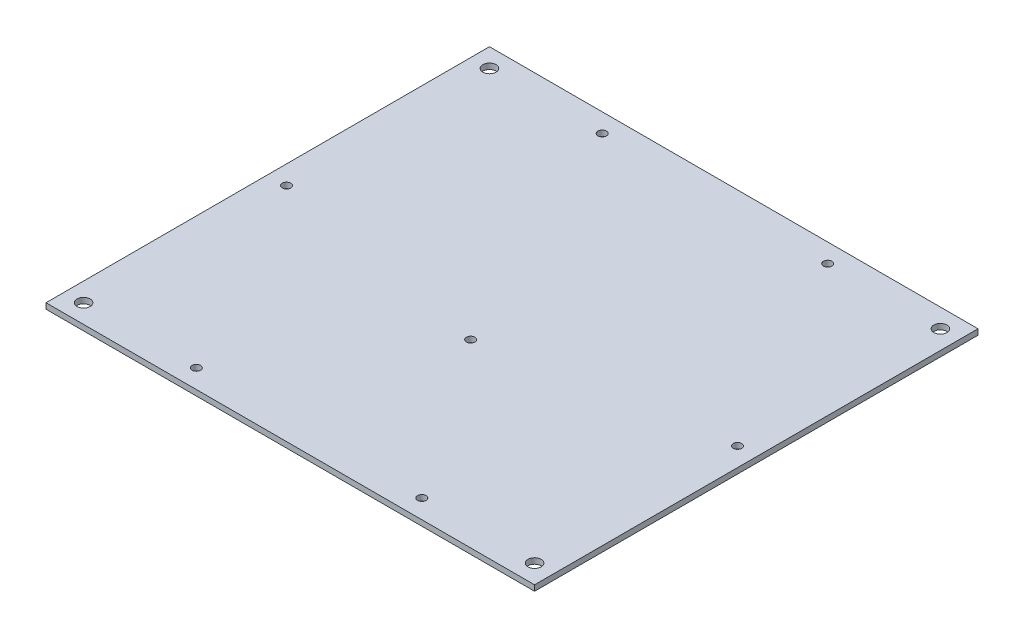
ISO-10303-21;
HEADER;
FILE_DESCRIPTION(('STEP AP214'),'2;1');
FILE_NAME('part.step','',(''),(''),'','','');
FILE_SCHEMA(('AUTOMOTIVE_DESIGN { 1 0 10303 214 1 1 1 1 }'));
ENDSEC;
DATA;
#1=APPLICATION_CONTEXT('core data for automotive mechanical design processes');
#2=APPLICATION_PROTOCOL_DEFINITION('international standard','automotive_design',2000,#1);
#3=PRODUCT_CONTEXT('',#1,'mechanical');
#4=PRODUCT('Part','Part','',(#3));
#5=PRODUCT_RELATED_PRODUCT_CATEGORY('part','',(#4));
#6=PRODUCT_DEFINITION_FORMATION('','',#4);
#7=PRODUCT_DEFINITION_CONTEXT('part definition',#1,'design');
#8=PRODUCT_DEFINITION('design','',#6,#7);
#9=PRODUCT_DEFINITION_SHAPE('','',#8);
#10=(LENGTH_UNIT() NAMED_UNIT(*) SI_UNIT(.MILLI.,.METRE.));
#11=(NAMED_UNIT(*) PLANE_ANGLE_UNIT() SI_UNIT($,.RADIAN.));
#12=(NAMED_UNIT(*) SI_UNIT($,.STERADIAN.) SOLID_ANGLE_UNIT());
#13=UNCERTAINTY_MEASURE_WITH_UNIT(LENGTH_MEASURE(1.E-05),#10,'distance_accuracy_value','');
#14=(GEOMETRIC_REPRESENTATION_CONTEXT(3) GLOBAL_UNCERTAINTY_ASSIGNED_CONTEXT((#13)) GLOBAL_UNIT_ASSIGNED_CONTEXT((#10,
#11,#12)) REPRESENTATION_CONTEXT('',''));
#15=CARTESIAN_POINT('',(0.,0.,0.));
#16=DIRECTION('',(0.,0.,1.));
#17=DIRECTION('',(1.,0.,0.));
#18=AXIS2_PLACEMENT_3D('',#15,#16,#17);
#19=CARTESIAN_POINT('',(0.,3.,0.));
#20=DIRECTION('',(0.,-1.,0.));
#21=DIRECTION('',(0.,0.,-1.));
#22=AXIS2_PLACEMENT_3D('',#19,#20,#21);
#23=PLANE('',#22);
#24=CARTESIAN_POINT('',(130.,3.,-96.0000000000006));
#25=DIRECTION('',(0.,1.,0.));
#26=DIRECTION('',(0.,0.,1.));
#27=AXIS2_PLACEMENT_3D('',#24,#25,#26);
#28=CIRCLE('',#27,2.25000000000001);
#29=CARTESIAN_POINT('',(130.,3.,-93.7500000000006));
#30=VERTEX_POINT('',#29);
#31=EDGE_CURVE('E175',#30,#30,#28,.T.);
#32=ORIENTED_EDGE('',*,*,#31,.F.);
#33=EDGE_LOOP('',(#32));
#34=FACE_BOUND('',#33,.T.);
#35=DIRECTION('',(0.,0.,1.));
#36=VECTOR('',#35,1.);
#37=CARTESIAN_POINT('',(0.,3.,0.));
#38=LINE('',#37,#36);
#39=CARTESIAN_POINT('',(0.,3.,-236.));
#40=VERTEX_POINT('',#39);
#41=CARTESIAN_POINT('',(0.,3.,0.));
#42=VERTEX_POINT('',#41);
#43=EDGE_CURVE('E88',#40,#42,#38,.T.);
#44=ORIENTED_EDGE('',*,*,#43,.T.);
#45=DIRECTION('',(1.,0.,0.));
#46=VECTOR('',#45,1.);
#47=CARTESIAN_POINT('',(0.,3.,0.));
#48=LINE('',#47,#46);
#49=CARTESIAN_POINT('',(260.,3.,0.));
#50=VERTEX_POINT('',#49);
#51=EDGE_CURVE('E83',#42,#50,#48,.T.);
#52=ORIENTED_EDGE('',*,*,#51,.T.);
#53=DIRECTION('',(0.,0.,-1.));
#54=VECTOR('',#53,1.);
#55=CARTESIAN_POINT('',(260.,3.,0.));
#56=LINE('',#55,#54);
#57=CARTESIAN_POINT('',(260.,3.,-236.));
#58=VERTEX_POINT('',#57);
#59=EDGE_CURVE('E86',#50,#58,#56,.T.);
#60=ORIENTED_EDGE('',*,*,#59,.T.);
#61=DIRECTION('',(-1.,0.,0.));
#62=VECTOR('',#61,1.);
#63=CARTESIAN_POINT('',(0.,3.,-236.));
#64=LINE('',#63,#62);
#65=EDGE_CURVE('E53',#58,#40,#64,.T.);
#66=ORIENTED_EDGE('',*,*,#65,.T.);
#67=EDGE_LOOP('',(#44,#52,#60,#66));
#68=FACE_BOUND('',#67,.T.);
#69=CARTESIAN_POINT('',(9.99999999999996,3.,-118.));
#70=DIRECTION('',(0.,1.,0.));
#71=DIRECTION('',(0.,0.,1.));
#72=AXIS2_PLACEMENT_3D('',#69,#70,#71);
#73=CIRCLE('',#72,2.25);
#74=CARTESIAN_POINT('',(9.99999999999996,3.,-115.75));
#75=VERTEX_POINT('',#74);
#76=EDGE_CURVE('E103',#75,#75,#73,.T.);
#77=ORIENTED_EDGE('',*,*,#76,.F.);
#78=EDGE_LOOP('',(#77));
#79=FACE_BOUND('',#78,.T.);
#80=CARTESIAN_POINT('',(250.,3.,-118.));
#81=DIRECTION('',(0.,1.,0.));
#82=DIRECTION('',(0.,0.,1.));
#83=AXIS2_PLACEMENT_3D('',#80,#81,#82);
#84=CIRCLE('',#83,2.24999999999995);
#85=CARTESIAN_POINT('',(250.,3.,-115.75));
#86=VERTEX_POINT('',#85);
#87=EDGE_CURVE('E118',#86,#86,#84,.T.);
#88=ORIENTED_EDGE('',*,*,#87,.F.);
#89=EDGE_LOOP('',(#88));
#90=FACE_BOUND('',#89,.T.);
#91=CARTESIAN_POINT('',(70.,3.,-226.));
#92=DIRECTION('',(0.,1.,0.));
#93=DIRECTION('',(0.,0.,1.));
#94=AXIS2_PLACEMENT_3D('',#91,#92,#93);
#95=CIRCLE('',#94,2.25);
#96=CARTESIAN_POINT('',(70.,3.,-223.75));
#97=VERTEX_POINT('',#96);
#98=EDGE_CURVE('E124',#97,#97,#95,.T.);
#99=ORIENTED_EDGE('',*,*,#98,.F.);
#100=EDGE_LOOP('',(#99));
#101=FACE_BOUND('',#100,.T.);
#102=CARTESIAN_POINT('',(190.,3.,-226.));
#103=DIRECTION('',(0.,1.,0.));
#104=DIRECTION('',(0.,0.,1.));
#105=AXIS2_PLACEMENT_3D('',#102,#103,#104);
#106=CIRCLE('',#105,2.24999999999995);
#107=CARTESIAN_POINT('',(190.,3.,-223.75));
#108=VERTEX_POINT('',#107);
#109=EDGE_CURVE('E130',#108,#108,#106,.T.);
#110=ORIENTED_EDGE('',*,*,#109,.F.);
#111=EDGE_LOOP('',(#110));
#112=FACE_BOUND('',#111,.T.);
#113=CARTESIAN_POINT('',(70.,3.,-10.));
#114=DIRECTION('',(0.,1.,0.));
#115=DIRECTION('',(0.,0.,1.));
#116=AXIS2_PLACEMENT_3D('',#113,#114,#115);
#117=CIRCLE('',#116,2.25);
#118=CARTESIAN_POINT('',(70.,3.,-7.75000000000001));
#119=VERTEX_POINT('',#118);
#120=EDGE_CURVE('E136',#119,#119,#117,.T.);
#121=ORIENTED_EDGE('',*,*,#120,.F.);
#122=EDGE_LOOP('',(#121));
#123=FACE_BOUND('',#122,.T.);
#124=CARTESIAN_POINT('',(190.,3.,-10.));
#125=DIRECTION('',(0.,1.,0.));
#126=DIRECTION('',(0.,0.,1.));
#127=AXIS2_PLACEMENT_3D('',#124,#125,#126);
#128=CIRCLE('',#127,2.24999999999995);
#129=CARTESIAN_POINT('',(190.,3.,-7.75000000000006));
#130=VERTEX_POINT('',#129);
#131=EDGE_CURVE('E142',#130,#130,#128,.T.);
#132=ORIENTED_EDGE('',*,*,#131,.F.);
#133=EDGE_LOOP('',(#132));
#134=FACE_BOUND('',#133,.T.);
#135=CARTESIAN_POINT('',(9.99999999999996,3.,-226.));
#136=DIRECTION('',(0.,1.,0.));
#137=DIRECTION('',(0.,0.,1.));
#138=AXIS2_PLACEMENT_3D('',#135,#136,#137);
#139=CIRCLE('',#138,3.5);
#140=CARTESIAN_POINT('',(9.99999999999996,3.,-222.5));
#141=VERTEX_POINT('',#140);
#142=EDGE_CURVE('E148',#141,#141,#139,.T.);
#143=ORIENTED_EDGE('',*,*,#142,.F.);
#144=EDGE_LOOP('',(#143));
#145=FACE_BOUND('',#144,.T.);
#146=CARTESIAN_POINT('',(250.,3.,-226.));
#147=DIRECTION('',(0.,1.,0.));
#148=DIRECTION('',(0.,0.,1.));
#149=AXIS2_PLACEMENT_3D('',#146,#147,#148);
#150=CIRCLE('',#149,3.50000000000002);
#151=CARTESIAN_POINT('',(250.,3.,-222.5));
#152=VERTEX_POINT('',#151);
#153=EDGE_CURVE('E154',#152,#152,#150,.T.);
#154=ORIENTED_EDGE('',*,*,#153,.F.);
#155=EDGE_LOOP('',(#154));
#156=FACE_BOUND('',#155,.T.);
#157=CARTESIAN_POINT('',(250.,3.,-10.));
#158=DIRECTION('',(0.,1.,0.));
#159=DIRECTION('',(0.,0.,1.));
#160=AXIS2_PLACEMENT_3D('',#157,#158,#159);
#161=CIRCLE('',#160,3.50000000000002);
#162=CARTESIAN_POINT('',(250.,3.,-6.49999999999999));
#163=VERTEX_POINT('',#162);
#164=EDGE_CURVE('E160',#163,#163,#161,.T.);
#165=ORIENTED_EDGE('',*,*,#164,.F.);
#166=EDGE_LOOP('',(#165));
#167=FACE_BOUND('',#166,.T.);
#168=CARTESIAN_POINT('',(9.99999999999997,3.,-10.));
#169=DIRECTION('',(0.,1.,0.));
#170=DIRECTION('',(0.,0.,1.));
#171=AXIS2_PLACEMENT_3D('',#168,#169,#170);
#172=CIRCLE('',#171,3.5);
#173=CARTESIAN_POINT('',(9.99999999999997,3.,-6.5));
#174=VERTEX_POINT('',#173);
#175=EDGE_CURVE('E166',#174,#174,#172,.T.);
#176=ORIENTED_EDGE('',*,*,#175,.F.);
#177=EDGE_LOOP('',(#176));
#178=FACE_BOUND('',#177,.T.);
#179=ADVANCED_FACE('F36',(#34,#68,#79,#90,#101,#112,#123,#134,#145,#156,#167,#178),#23,.F.);
#180=CARTESIAN_POINT('',(0.,0.,0.));
#181=DIRECTION('',(0.,-1.,0.));
#182=DIRECTION('',(0.,0.,-1.));
#183=AXIS2_PLACEMENT_3D('',#180,#181,#182);
#184=PLANE('',#183);
#185=CARTESIAN_POINT('',(130.,0.,-96.0000000000006));
#186=DIRECTION('',(0.,1.,0.));
#187=DIRECTION('',(0.,0.,1.));
#188=AXIS2_PLACEMENT_3D('',#185,#186,#187);
#189=CIRCLE('',#188,2.25000000000001);
#190=CARTESIAN_POINT('',(130.,0.,-93.7500000000006));
#191=VERTEX_POINT('',#190);
#192=EDGE_CURVE('E172',#191,#191,#189,.T.);
#193=ORIENTED_EDGE('',*,*,#192,.T.);
#194=EDGE_LOOP('',(#193));
#195=FACE_BOUND('',#194,.T.);
#196=CARTESIAN_POINT('',(250.,0.,-10.));
#197=DIRECTION('',(0.,1.,0.));
#198=DIRECTION('',(0.,0.,1.));
#199=AXIS2_PLACEMENT_3D('',#196,#197,#198);
#200=CIRCLE('',#199,3.50000000000002);
#201=CARTESIAN_POINT('',(250.,0.,-6.49999999999999));
#202=VERTEX_POINT('',#201);
#203=EDGE_CURVE('E163',#202,#202,#200,.T.);
#204=ORIENTED_EDGE('',*,*,#203,.T.);
#205=EDGE_LOOP('',(#204));
#206=FACE_BOUND('',#205,.T.);
#207=CARTESIAN_POINT('',(9.99999999999996,0.,-226.));
#208=DIRECTION('',(0.,1.,0.));
#209=DIRECTION('',(0.,0.,1.));
#210=AXIS2_PLACEMENT_3D('',#207,#208,#209);
#211=CIRCLE('',#210,3.5);
#212=CARTESIAN_POINT('',(9.99999999999996,0.,-222.5));
#213=VERTEX_POINT('',#212);
#214=EDGE_CURVE('E151',#213,#213,#211,.T.);
#215=ORIENTED_EDGE('',*,*,#214,.T.);
#216=EDGE_LOOP('',(#215));
#217=FACE_BOUND('',#216,.T.);
#218=CARTESIAN_POINT('',(70.,0.,-10.));
#219=DIRECTION('',(0.,1.,0.));
#220=DIRECTION('',(0.,0.,1.));
#221=AXIS2_PLACEMENT_3D('',#218,#219,#220);
#222=CIRCLE('',#221,2.25);
#223=CARTESIAN_POINT('',(70.,0.,-7.75000000000001));
#224=VERTEX_POINT('',#223);
#225=EDGE_CURVE('E139',#224,#224,#222,.T.);
#226=ORIENTED_EDGE('',*,*,#225,.T.);
#227=EDGE_LOOP('',(#226));
#228=FACE_BOUND('',#227,.T.);
#229=CARTESIAN_POINT('',(70.,0.,-226.));
#230=DIRECTION('',(0.,1.,0.));
#231=DIRECTION('',(0.,0.,1.));
#232=AXIS2_PLACEMENT_3D('',#229,#230,#231);
#233=CIRCLE('',#232,2.25);
#234=CARTESIAN_POINT('',(70.,0.,-223.75));
#235=VERTEX_POINT('',#234);
#236=EDGE_CURVE('E127',#235,#235,#233,.T.);
#237=ORIENTED_EDGE('',*,*,#236,.T.);
#238=EDGE_LOOP('',(#237));
#239=FACE_BOUND('',#238,.T.);
#240=CARTESIAN_POINT('',(9.99999999999996,0.,-118.));
#241=DIRECTION('',(0.,1.,0.));
#242=DIRECTION('',(0.,0.,1.));
#243=AXIS2_PLACEMENT_3D('',#240,#241,#242);
#244=CIRCLE('',#243,2.25);
#245=CARTESIAN_POINT('',(9.99999999999996,0.,-115.75));
#246=VERTEX_POINT('',#245);
#247=EDGE_CURVE('E115',#246,#246,#244,.T.);
#248=ORIENTED_EDGE('',*,*,#247,.T.);
#249=EDGE_LOOP('',(#248));
#250=FACE_BOUND('',#249,.T.);
#251=DIRECTION('',(0.,0.,1.));
#252=VECTOR('',#251,1.);
#253=CARTESIAN_POINT('',(0.,0.,0.));
#254=LINE('',#253,#252);
#255=CARTESIAN_POINT('',(0.,0.,-236.));
#256=VERTEX_POINT('',#255);
#257=CARTESIAN_POINT('',(0.,0.,0.));
#258=VERTEX_POINT('',#257);
#259=EDGE_CURVE('E100',#256,#258,#254,.T.);
#260=ORIENTED_EDGE('',*,*,#259,.F.);
#261=DIRECTION('',(-1.,0.,0.));
#262=VECTOR('',#261,1.);
#263=CARTESIAN_POINT('',(0.,0.,-236.));
#264=LINE('',#263,#262);
#265=CARTESIAN_POINT('',(260.,0.,-236.));
#266=VERTEX_POINT('',#265);
#267=EDGE_CURVE('E76',#266,#256,#264,.T.);
#268=ORIENTED_EDGE('',*,*,#267,.F.);
#269=DIRECTION('',(0.,0.,-1.));
#270=VECTOR('',#269,1.);
#271=CARTESIAN_POINT('',(260.,0.,0.));
#272=LINE('',#271,#270);
#273=CARTESIAN_POINT('',(260.,0.,0.));
#274=VERTEX_POINT('',#273);
#275=EDGE_CURVE('E70',#274,#266,#272,.T.);
#276=ORIENTED_EDGE('',*,*,#275,.F.);
#277=DIRECTION('',(1.,0.,0.));
#278=VECTOR('',#277,1.);
#279=CARTESIAN_POINT('',(0.,0.,0.));
#280=LINE('',#279,#278);
#281=EDGE_CURVE('E92',#258,#274,#280,.T.);
#282=ORIENTED_EDGE('',*,*,#281,.F.);
#283=EDGE_LOOP('',(#260,#268,#276,#282));
#284=FACE_BOUND('',#283,.T.);
#285=CARTESIAN_POINT('',(250.,0.,-118.));
#286=DIRECTION('',(0.,1.,0.));
#287=DIRECTION('',(0.,0.,1.));
#288=AXIS2_PLACEMENT_3D('',#285,#286,#287);
#289=CIRCLE('',#288,2.24999999999995);
#290=CARTESIAN_POINT('',(250.,0.,-115.75));
#291=VERTEX_POINT('',#290);
#292=EDGE_CURVE('E121',#291,#291,#289,.T.);
#293=ORIENTED_EDGE('',*,*,#292,.T.);
#294=EDGE_LOOP('',(#293));
#295=FACE_BOUND('',#294,.T.);
#296=CARTESIAN_POINT('',(190.,0.,-226.));
#297=DIRECTION('',(0.,1.,0.));
#298=DIRECTION('',(0.,0.,1.));
#299=AXIS2_PLACEMENT_3D('',#296,#297,#298);
#300=CIRCLE('',#299,2.24999999999995);
#301=CARTESIAN_POINT('',(190.,0.,-223.75));
#302=VERTEX_POINT('',#301);
#303=EDGE_CURVE('E133',#302,#302,#300,.T.);
#304=ORIENTED_EDGE('',*,*,#303,.T.);
#305=EDGE_LOOP('',(#304));
#306=FACE_BOUND('',#305,.T.);
#307=CARTESIAN_POINT('',(190.,0.,-10.));
#308=DIRECTION('',(0.,1.,0.));
#309=DIRECTION('',(0.,0.,1.));
#310=AXIS2_PLACEMENT_3D('',#307,#308,#309);
#311=CIRCLE('',#310,2.24999999999995);
#312=CARTESIAN_POINT('',(190.,0.,-7.75000000000006));
#313=VERTEX_POINT('',#312);
#314=EDGE_CURVE('E145',#313,#313,#311,.T.);
#315=ORIENTED_EDGE('',*,*,#314,.T.);
#316=EDGE_LOOP('',(#315));
#317=FACE_BOUND('',#316,.T.);
#318=CARTESIAN_POINT('',(250.,0.,-226.));
#319=DIRECTION('',(0.,1.,0.));
#320=DIRECTION('',(0.,0.,1.));
#321=AXIS2_PLACEMENT_3D('',#318,#319,#320);
#322=CIRCLE('',#321,3.50000000000002);
#323=CARTESIAN_POINT('',(250.,0.,-222.5));
#324=VERTEX_POINT('',#323);
#325=EDGE_CURVE('E157',#324,#324,#322,.T.);
#326=ORIENTED_EDGE('',*,*,#325,.T.);
#327=EDGE_LOOP('',(#326));
#328=FACE_BOUND('',#327,.T.);
#329=CARTESIAN_POINT('',(9.99999999999997,0.,-10.));
#330=DIRECTION('',(0.,1.,0.));
#331=DIRECTION('',(0.,0.,1.));
#332=AXIS2_PLACEMENT_3D('',#329,#330,#331);
#333=CIRCLE('',#332,3.5);
#334=CARTESIAN_POINT('',(9.99999999999997,0.,-6.5));
#335=VERTEX_POINT('',#334);
#336=EDGE_CURVE('E169',#335,#335,#333,.T.);
#337=ORIENTED_EDGE('',*,*,#336,.T.);
#338=EDGE_LOOP('',(#337));
#339=FACE_BOUND('',#338,.T.);
#340=ADVANCED_FACE('F111',(#195,#206,#217,#228,#239,#250,#284,#295,#306,#317,#328,#339),#184,.T.);
#341=CARTESIAN_POINT('',(0.,3.,0.));
#342=DIRECTION('',(1.,0.,0.));
#343=DIRECTION('',(0.,0.,-1.));
#344=AXIS2_PLACEMENT_3D('',#341,#342,#343);
#345=PLANE('',#344);
#346=ORIENTED_EDGE('',*,*,#259,.T.);
#347=DIRECTION('',(0.,-1.,0.));
#348=VECTOR('',#347,1.);
#349=CARTESIAN_POINT('',(0.,3.,0.));
#350=LINE('',#349,#348);
#351=EDGE_CURVE('E11',#42,#258,#350,.T.);
#352=ORIENTED_EDGE('',*,*,#351,.F.);
#353=ORIENTED_EDGE('',*,*,#43,.F.);
#354=DIRECTION('',(0.,-1.,0.));
#355=VECTOR('',#354,1.);
#356=CARTESIAN_POINT('',(0.,3.,-236.));
#357=LINE('',#356,#355);
#358=EDGE_CURVE('E96',#40,#256,#357,.T.);
#359=ORIENTED_EDGE('',*,*,#358,.T.);
#360=EDGE_LOOP('',(#346,#352,#353,#359));
#361=FACE_BOUND('',#360,.T.);
#362=ADVANCED_FACE('F38',(#361),#345,.F.);
#363=CARTESIAN_POINT('',(0.,3.,0.));
#364=DIRECTION('',(0.,0.,-1.));
#365=DIRECTION('',(-1.,0.,0.));
#366=AXIS2_PLACEMENT_3D('',#363,#364,#365);
#367=PLANE('',#366);
#368=ORIENTED_EDGE('',*,*,#281,.T.);
#369=DIRECTION('',(0.,-1.,0.));
#370=VECTOR('',#369,1.);
#371=CARTESIAN_POINT('',(260.,3.,0.));
#372=LINE('',#371,#370);
#373=EDGE_CURVE('E45',#50,#274,#372,.T.);
#374=ORIENTED_EDGE('',*,*,#373,.F.);
#375=ORIENTED_EDGE('',*,*,#51,.F.);
#376=ORIENTED_EDGE('',*,*,#351,.T.);
#377=EDGE_LOOP('',(#368,#374,#375,#376));
#378=FACE_BOUND('',#377,.T.);
#379=ADVANCED_FACE('F91',(#378),#367,.F.);
#380=CARTESIAN_POINT('',(260.,3.,0.));
#381=DIRECTION('',(-1.,0.,0.));
#382=DIRECTION('',(0.,0.,1.));
#383=AXIS2_PLACEMENT_3D('',#380,#381,#382);
#384=PLANE('',#383);
#385=ORIENTED_EDGE('',*,*,#275,.T.);
#386=DIRECTION('',(0.,-1.,0.));
#387=VECTOR('',#386,1.);
#388=CARTESIAN_POINT('',(260.,3.,-236.));
#389=LINE('',#388,#387);
#390=EDGE_CURVE('E93',#58,#266,#389,.T.);
#391=ORIENTED_EDGE('',*,*,#390,.F.);
#392=ORIENTED_EDGE('',*,*,#59,.F.);
#393=ORIENTED_EDGE('',*,*,#373,.T.);
#394=EDGE_LOOP('',(#385,#391,#392,#393));
#395=FACE_BOUND('',#394,.T.);
#396=ADVANCED_FACE('F94',(#395),#384,.F.);
#397=CARTESIAN_POINT('',(0.,3.,-236.));
#398=DIRECTION('',(0.,0.,1.));
#399=DIRECTION('',(1.,0.,0.));
#400=AXIS2_PLACEMENT_3D('',#397,#398,#399);
#401=PLANE('',#400);
#402=ORIENTED_EDGE('',*,*,#267,.T.);
#403=ORIENTED_EDGE('',*,*,#358,.F.);
#404=ORIENTED_EDGE('',*,*,#65,.F.);
#405=ORIENTED_EDGE('',*,*,#390,.T.);
#406=EDGE_LOOP('',(#402,#403,#404,#405));
#407=FACE_BOUND('',#406,.T.);
#408=ADVANCED_FACE('F108',(#407),#401,.F.);
#409=CARTESIAN_POINT('',(9.99999999999996,3.,-118.));
#410=DIRECTION('',(0.,-1.,0.));
#411=DIRECTION('',(0.,0.,-1.));
#412=AXIS2_PLACEMENT_3D('',#409,#410,#411);
#413=CYLINDRICAL_SURFACE('',#412,2.25);
#414=ORIENTED_EDGE('',*,*,#76,.T.);
#415=EDGE_LOOP('',(#414));
#416=FACE_BOUND('',#415,.T.);
#417=ORIENTED_EDGE('',*,*,#247,.F.);
#418=EDGE_LOOP('',(#417));
#419=FACE_BOUND('',#418,.T.);
#420=ADVANCED_FACE('F198',(#416,#419),#413,.F.);
#421=CARTESIAN_POINT('',(250.,3.,-118.));
#422=DIRECTION('',(0.,-1.,0.));
#423=DIRECTION('',(0.,0.,-1.));
#424=AXIS2_PLACEMENT_3D('',#421,#422,#423);
#425=CYLINDRICAL_SURFACE('',#424,2.24999999999995);
#426=ORIENTED_EDGE('',*,*,#87,.T.);
#427=EDGE_LOOP('',(#426));
#428=FACE_BOUND('',#427,.T.);
#429=ORIENTED_EDGE('',*,*,#292,.F.);
#430=EDGE_LOOP('',(#429));
#431=FACE_BOUND('',#430,.T.);
#432=ADVANCED_FACE('F287',(#428,#431),#425,.F.);
#433=CARTESIAN_POINT('',(70.,3.,-226.));
#434=DIRECTION('',(0.,-1.,0.));
#435=DIRECTION('',(0.,0.,-1.));
#436=AXIS2_PLACEMENT_3D('',#433,#434,#435);
#437=CYLINDRICAL_SURFACE('',#436,2.25);
#438=ORIENTED_EDGE('',*,*,#98,.T.);
#439=EDGE_LOOP('',(#438));
#440=FACE_BOUND('',#439,.T.);
#441=ORIENTED_EDGE('',*,*,#236,.F.);
#442=EDGE_LOOP('',(#441));
#443=FACE_BOUND('',#442,.T.);
#444=ADVANCED_FACE('F279',(#440,#443),#437,.F.);
#445=CARTESIAN_POINT('',(190.,3.,-226.));
#446=DIRECTION('',(0.,-1.,0.));
#447=DIRECTION('',(0.,0.,-1.));
#448=AXIS2_PLACEMENT_3D('',#445,#446,#447);
#449=CYLINDRICAL_SURFACE('',#448,2.24999999999995);
#450=ORIENTED_EDGE('',*,*,#109,.T.);
#451=EDGE_LOOP('',(#450));
#452=FACE_BOUND('',#451,.T.);
#453=ORIENTED_EDGE('',*,*,#303,.F.);
#454=EDGE_LOOP('',(#453));
#455=FACE_BOUND('',#454,.T.);
#456=ADVANCED_FACE('F271',(#452,#455),#449,.F.);
#457=CARTESIAN_POINT('',(70.,3.,-10.));
#458=DIRECTION('',(0.,-1.,0.));
#459=DIRECTION('',(0.,0.,-1.));
#460=AXIS2_PLACEMENT_3D('',#457,#458,#459);
#461=CYLINDRICAL_SURFACE('',#460,2.25);
#462=ORIENTED_EDGE('',*,*,#120,.T.);
#463=EDGE_LOOP('',(#462));
#464=FACE_BOUND('',#463,.T.);
#465=ORIENTED_EDGE('',*,*,#225,.F.);
#466=EDGE_LOOP('',(#465));
#467=FACE_BOUND('',#466,.T.);
#468=ADVANCED_FACE('F263',(#464,#467),#461,.F.);
#469=CARTESIAN_POINT('',(190.,3.,-10.));
#470=DIRECTION('',(0.,-1.,0.));
#471=DIRECTION('',(0.,0.,-1.));
#472=AXIS2_PLACEMENT_3D('',#469,#470,#471);
#473=CYLINDRICAL_SURFACE('',#472,2.24999999999995);
#474=ORIENTED_EDGE('',*,*,#131,.T.);
#475=EDGE_LOOP('',(#474));
#476=FACE_BOUND('',#475,.T.);
#477=ORIENTED_EDGE('',*,*,#314,.F.);
#478=EDGE_LOOP('',(#477));
#479=FACE_BOUND('',#478,.T.);
#480=ADVANCED_FACE('F255',(#476,#479),#473,.F.);
#481=CARTESIAN_POINT('',(9.99999999999996,3.,-226.));
#482=DIRECTION('',(0.,-1.,0.));
#483=DIRECTION('',(0.,0.,-1.));
#484=AXIS2_PLACEMENT_3D('',#481,#482,#483);
#485=CYLINDRICAL_SURFACE('',#484,3.5);
#486=ORIENTED_EDGE('',*,*,#142,.T.);
#487=EDGE_LOOP('',(#486));
#488=FACE_BOUND('',#487,.T.);
#489=ORIENTED_EDGE('',*,*,#214,.F.);
#490=EDGE_LOOP('',(#489));
#491=FACE_BOUND('',#490,.T.);
#492=ADVANCED_FACE('F247',(#488,#491),#485,.F.);
#493=CARTESIAN_POINT('',(250.,3.,-226.));
#494=DIRECTION('',(0.,-1.,0.));
#495=DIRECTION('',(0.,0.,-1.));
#496=AXIS2_PLACEMENT_3D('',#493,#494,#495);
#497=CYLINDRICAL_SURFACE('',#496,3.50000000000002);
#498=ORIENTED_EDGE('',*,*,#153,.T.);
#499=EDGE_LOOP('',(#498));
#500=FACE_BOUND('',#499,.T.);
#501=ORIENTED_EDGE('',*,*,#325,.F.);
#502=EDGE_LOOP('',(#501));
#503=FACE_BOUND('',#502,.T.);
#504=ADVANCED_FACE('F239',(#500,#503),#497,.F.);
#505=CARTESIAN_POINT('',(250.,3.,-10.));
#506=DIRECTION('',(0.,-1.,0.));
#507=DIRECTION('',(0.,0.,-1.));
#508=AXIS2_PLACEMENT_3D('',#505,#506,#507);
#509=CYLINDRICAL_SURFACE('',#508,3.50000000000002);
#510=ORIENTED_EDGE('',*,*,#164,.T.);
#511=EDGE_LOOP('',(#510));
#512=FACE_BOUND('',#511,.T.);
#513=ORIENTED_EDGE('',*,*,#203,.F.);
#514=EDGE_LOOP('',(#513));
#515=FACE_BOUND('',#514,.T.);
#516=ADVANCED_FACE('F232',(#512,#515),#509,.F.);
#517=CARTESIAN_POINT('',(9.99999999999997,3.,-10.));
#518=DIRECTION('',(0.,-1.,0.));
#519=DIRECTION('',(0.,0.,-1.));
#520=AXIS2_PLACEMENT_3D('',#517,#518,#519);
#521=CYLINDRICAL_SURFACE('',#520,3.5);
#522=ORIENTED_EDGE('',*,*,#175,.T.);
#523=EDGE_LOOP('',(#522));
#524=FACE_BOUND('',#523,.T.);
#525=ORIENTED_EDGE('',*,*,#336,.F.);
#526=EDGE_LOOP('',(#525));
#527=FACE_BOUND('',#526,.T.);
#528=ADVANCED_FACE('F186',(#524,#527),#521,.F.);
#529=CARTESIAN_POINT('',(130.,0.,-96.0000000000006));
#530=DIRECTION('',(0.,1.,0.));
#531=DIRECTION('',(0.,0.,1.));
#532=AXIS2_PLACEMENT_3D('',#529,#530,#531);
#533=CYLINDRICAL_SURFACE('',#532,2.25000000000001);
#534=ORIENTED_EDGE('',*,*,#192,.F.);
#535=EDGE_LOOP('',(#534));
#536=FACE_BOUND('',#535,.T.);
#537=ORIENTED_EDGE('',*,*,#31,.T.);
#538=EDGE_LOOP('',(#537));
#539=FACE_BOUND('',#538,.T.);
#540=ADVANCED_FACE('F183',(#536,#539),#533,.F.);
#541=CLOSED_SHELL('',(#179,#340,#362,#379,#396,#408,#420,#432,#444,#456,#468,#480,#492,#504,
#516,#528,#540));
#542=MANIFOLD_SOLID_BREP('B2',#541);
#543=ADVANCED_BREP_SHAPE_REPRESENTATION('',(#18,#542),#14);
#544=SHAPE_DEFINITION_REPRESENTATION(#9,#543);
ENDSEC;
END-ISO-10303-21;
